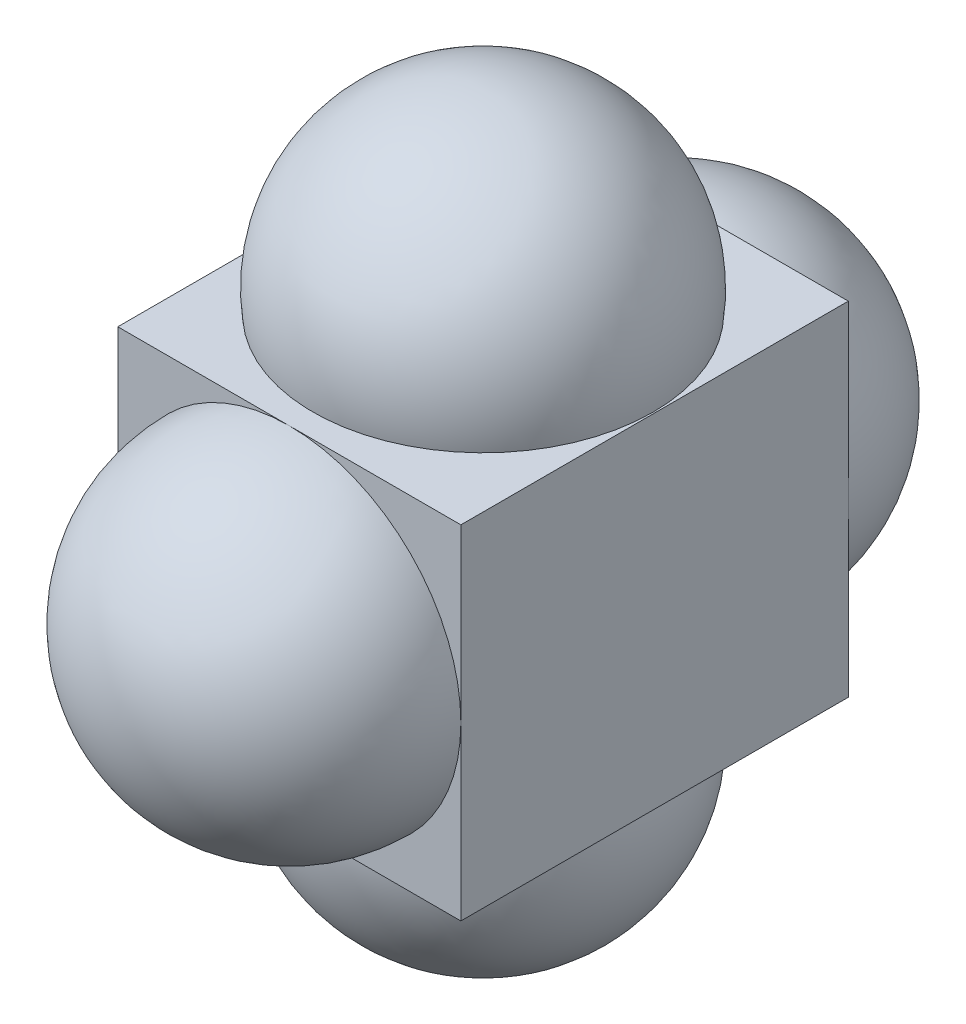
ISO-10303-21;
HEADER;
FILE_DESCRIPTION(('STEP AP214'),'2;1');
FILE_NAME('part.step','',(''),(''),'','','');
FILE_SCHEMA(('AUTOMOTIVE_DESIGN { 1 0 10303 214 1 1 1 1 }'));
ENDSEC;
DATA;
#1=APPLICATION_CONTEXT('core data for automotive mechanical design processes');
#2=APPLICATION_PROTOCOL_DEFINITION('international standard','automotive_design',2000,#1);
#3=PRODUCT_CONTEXT('',#1,'mechanical');
#4=PRODUCT('Part','Part','',(#3));
#5=PRODUCT_RELATED_PRODUCT_CATEGORY('part','',(#4));
#6=PRODUCT_DEFINITION_FORMATION('','',#4);
#7=PRODUCT_DEFINITION_CONTEXT('part definition',#1,'design');
#8=PRODUCT_DEFINITION('design','',#6,#7);
#9=PRODUCT_DEFINITION_SHAPE('','',#8);
#10=(LENGTH_UNIT() NAMED_UNIT(*) SI_UNIT(.MILLI.,.METRE.));
#11=(NAMED_UNIT(*) PLANE_ANGLE_UNIT() SI_UNIT($,.RADIAN.));
#12=(NAMED_UNIT(*) SI_UNIT($,.STERADIAN.) SOLID_ANGLE_UNIT());
#13=UNCERTAINTY_MEASURE_WITH_UNIT(LENGTH_MEASURE(1.E-05),#10,'distance_accuracy_value','');
#14=(GEOMETRIC_REPRESENTATION_CONTEXT(3) GLOBAL_UNCERTAINTY_ASSIGNED_CONTEXT((#13)) GLOBAL_UNIT_ASSIGNED_CONTEXT((#10,
#11,#12)) REPRESENTATION_CONTEXT('',''));
#15=CARTESIAN_POINT('',(0.,0.,0.));
#16=DIRECTION('',(0.,0.,1.));
#17=DIRECTION('',(1.,0.,0.));
#18=AXIS2_PLACEMENT_3D('',#15,#16,#17);
#19=CARTESIAN_POINT('',(-3.92641666666667,-3.92641666666667,-4.43441666666667));
#20=DIRECTION('',(0.,0.,1.));
#21=DIRECTION('',(1.,0.,0.));
#22=AXIS2_PLACEMENT_3D('',#19,#20,#21);
#23=PLANE('',#22);
#24=CARTESIAN_POINT('',(0.,0.,-4.43441666666667));
#25=DIRECTION('',(0.,0.,1.));
#26=DIRECTION('',(1.,0.,0.));
#27=AXIS2_PLACEMENT_3D('',#24,#25,#26);
#28=CIRCLE('',#27,3.92641666666667);
#29=CARTESIAN_POINT('',(3.92641666666666,0.,-4.43441666666667));
#30=VERTEX_POINT('',#29);
#31=CARTESIAN_POINT('',(0.,-3.92641666666667,-4.43441666666667));
#32=VERTEX_POINT('',#31);
#33=EDGE_CURVE('E11',#30,#32,#28,.F.);
#34=ORIENTED_EDGE('',*,*,#33,.F.);
#35=DIRECTION('',(0.,1.,0.));
#36=VECTOR('',#35,1.);
#37=CARTESIAN_POINT('',(3.92641666666666,3.92641666666666,-4.43441666666667));
#38=LINE('',#37,#36);
#39=CARTESIAN_POINT('',(3.92641666666666,-3.92641666666667,-4.43441666666667));
#40=VERTEX_POINT('',#39);
#41=EDGE_CURVE('E106',#40,#30,#38,.T.);
#42=ORIENTED_EDGE('',*,*,#41,.F.);
#43=DIRECTION('',(1.,0.,0.));
#44=VECTOR('',#43,1.);
#45=CARTESIAN_POINT('',(-3.92641666666667,-3.92641666666667,-4.43441666666667));
#46=LINE('',#45,#44);
#47=EDGE_CURVE('E122',#32,#40,#46,.T.);
#48=ORIENTED_EDGE('',*,*,#47,.F.);
#49=EDGE_LOOP('',(#34,#42,#48));
#50=FACE_BOUND('',#49,.T.);
#51=ADVANCED_FACE('F38',(#50),#23,.F.);
#52=CARTESIAN_POINT('',(-3.92641666666667,0.,-4.43441666666667));
#53=VERTEX_POINT('',#52);
#54=EDGE_CURVE('E47',#32,#53,#28,.F.);
#55=ORIENTED_EDGE('',*,*,#54,.F.);
#56=CARTESIAN_POINT('',(-3.92641666666667,-3.92641666666667,-4.43441666666667));
#57=VERTEX_POINT('',#56);
#58=EDGE_CURVE('E121',#57,#32,#46,.T.);
#59=ORIENTED_EDGE('',*,*,#58,.F.);
#60=DIRECTION('',(0.,-1.,0.));
#61=VECTOR('',#60,1.);
#62=CARTESIAN_POINT('',(-3.92641666666667,3.92641666666666,-4.43441666666667));
#63=LINE('',#62,#61);
#64=EDGE_CURVE('E167',#53,#57,#63,.T.);
#65=ORIENTED_EDGE('',*,*,#64,.F.);
#66=EDGE_LOOP('',(#55,#59,#65));
#67=FACE_BOUND('',#66,.T.);
#68=ADVANCED_FACE('F192',(#67),#23,.F.);
#69=CARTESIAN_POINT('',(0.,3.92641666666666,-4.43441666666667));
#70=VERTEX_POINT('',#69);
#71=EDGE_CURVE('E127',#53,#70,#28,.F.);
#72=ORIENTED_EDGE('',*,*,#71,.F.);
#73=CARTESIAN_POINT('',(-3.92641666666667,3.92641666666666,-4.43441666666667));
#74=VERTEX_POINT('',#73);
#75=EDGE_CURVE('E164',#74,#53,#63,.T.);
#76=ORIENTED_EDGE('',*,*,#75,.F.);
#77=DIRECTION('',(-1.,0.,0.));
#78=VECTOR('',#77,1.);
#79=CARTESIAN_POINT('',(-3.92641666666667,3.92641666666666,-4.43441666666667));
#80=LINE('',#79,#78);
#81=EDGE_CURVE('E116',#70,#74,#80,.T.);
#82=ORIENTED_EDGE('',*,*,#81,.F.);
#83=EDGE_LOOP('',(#72,#76,#82));
#84=FACE_BOUND('',#83,.T.);
#85=ADVANCED_FACE('F202',(#84),#23,.F.);
#86=EDGE_CURVE('E42',#70,#30,#28,.F.);
#87=ORIENTED_EDGE('',*,*,#86,.F.);
#88=CARTESIAN_POINT('',(3.92641666666666,3.92641666666666,-4.43441666666667));
#89=VERTEX_POINT('',#88);
#90=EDGE_CURVE('E120',#89,#70,#80,.T.);
#91=ORIENTED_EDGE('',*,*,#90,.F.);
#92=EDGE_CURVE('E109',#30,#89,#38,.T.);
#93=ORIENTED_EDGE('',*,*,#92,.F.);
#94=EDGE_LOOP('',(#87,#91,#93));
#95=FACE_BOUND('',#94,.T.);
#96=ADVANCED_FACE('F118',(#95),#23,.F.);
#97=CARTESIAN_POINT('',(-3.92641666666667,-3.92641666666667,4.43441666666667));
#98=DIRECTION('',(0.,0.,1.));
#99=DIRECTION('',(1.,0.,0.));
#100=AXIS2_PLACEMENT_3D('',#97,#98,#99);
#101=PLANE('',#100);
#102=DIRECTION('',(0.,1.,0.));
#103=VECTOR('',#102,1.);
#104=CARTESIAN_POINT('',(3.92641666666666,3.92641666666666,4.43441666666667));
#105=LINE('',#104,#103);
#106=CARTESIAN_POINT('',(3.92641666666666,-3.92641666666667,4.43441666666667));
#107=VERTEX_POINT('',#106);
#108=CARTESIAN_POINT('',(3.92641666666666,0.,4.43441666666667));
#109=VERTEX_POINT('',#108);
#110=EDGE_CURVE('E170',#107,#109,#105,.T.);
#111=ORIENTED_EDGE('',*,*,#110,.T.);
#112=CARTESIAN_POINT('',(0.,0.,4.43441666666667));
#113=DIRECTION('',(0.,0.,1.));
#114=DIRECTION('',(1.,0.,0.));
#115=AXIS2_PLACEMENT_3D('',#112,#113,#114);
#116=CIRCLE('',#115,3.92641666666666);
#117=CARTESIAN_POINT('',(0.,-3.92641666666667,4.43441666666667));
#118=VERTEX_POINT('',#117);
#119=EDGE_CURVE('E128',#109,#118,#116,.F.);
#120=ORIENTED_EDGE('',*,*,#119,.T.);
#121=DIRECTION('',(1.,0.,0.));
#122=VECTOR('',#121,1.);
#123=CARTESIAN_POINT('',(-3.92641666666667,-3.92641666666667,4.43441666666667));
#124=LINE('',#123,#122);
#125=EDGE_CURVE('E176',#118,#107,#124,.T.);
#126=ORIENTED_EDGE('',*,*,#125,.T.);
#127=EDGE_LOOP('',(#111,#120,#126));
#128=FACE_BOUND('',#127,.T.);
#129=ADVANCED_FACE('F193',(#128),#101,.T.);
#130=CARTESIAN_POINT('',(-3.92641666666667,-3.92641666666667,4.43441666666667));
#131=VERTEX_POINT('',#130);
#132=EDGE_CURVE('E173',#131,#118,#124,.T.);
#133=ORIENTED_EDGE('',*,*,#132,.T.);
#134=CARTESIAN_POINT('',(-3.92641666666667,0.,4.43441666666667));
#135=VERTEX_POINT('',#134);
#136=EDGE_CURVE('E130',#118,#135,#116,.F.);
#137=ORIENTED_EDGE('',*,*,#136,.T.);
#138=DIRECTION('',(0.,-1.,0.));
#139=VECTOR('',#138,1.);
#140=CARTESIAN_POINT('',(-3.92641666666667,3.92641666666666,4.43441666666667));
#141=LINE('',#140,#139);
#142=EDGE_CURVE('E161',#135,#131,#141,.T.);
#143=ORIENTED_EDGE('',*,*,#142,.T.);
#144=EDGE_LOOP('',(#133,#137,#143));
#145=FACE_BOUND('',#144,.T.);
#146=ADVANCED_FACE('F184',(#145),#101,.T.);
#147=CARTESIAN_POINT('',(-3.92641666666667,3.92641666666666,4.43441666666667));
#148=VERTEX_POINT('',#147);
#149=EDGE_CURVE('E177',#148,#135,#141,.T.);
#150=ORIENTED_EDGE('',*,*,#149,.T.);
#151=CARTESIAN_POINT('',(0.,3.92641666666666,4.43441666666667));
#152=VERTEX_POINT('',#151);
#153=EDGE_CURVE('E136',#135,#152,#116,.F.);
#154=ORIENTED_EDGE('',*,*,#153,.T.);
#155=DIRECTION('',(-1.,0.,0.));
#156=VECTOR('',#155,1.);
#157=CARTESIAN_POINT('',(-3.92641666666667,3.92641666666666,4.43441666666667));
#158=LINE('',#157,#156);
#159=EDGE_CURVE('E169',#152,#148,#158,.T.);
#160=ORIENTED_EDGE('',*,*,#159,.T.);
#161=EDGE_LOOP('',(#150,#154,#160));
#162=FACE_BOUND('',#161,.T.);
#163=ADVANCED_FACE('F201',(#162),#101,.T.);
#164=CARTESIAN_POINT('',(3.92641666666666,3.92641666666666,4.43441666666667));
#165=VERTEX_POINT('',#164);
#166=EDGE_CURVE('E160',#165,#152,#158,.T.);
#167=ORIENTED_EDGE('',*,*,#166,.T.);
#168=EDGE_CURVE('E131',#152,#109,#116,.F.);
#169=ORIENTED_EDGE('',*,*,#168,.T.);
#170=EDGE_CURVE('E172',#109,#165,#105,.T.);
#171=ORIENTED_EDGE('',*,*,#170,.T.);
#172=EDGE_LOOP('',(#167,#169,#171));
#173=FACE_BOUND('',#172,.T.);
#174=ADVANCED_FACE('F196',(#173),#101,.T.);
#175=CARTESIAN_POINT('',(-3.92641666666667,-3.92641666666667,4.43441666666667));
#176=DIRECTION('',(0.,1.,0.));
#177=DIRECTION('',(0.,0.,1.));
#178=AXIS2_PLACEMENT_3D('',#175,#176,#177);
#179=PLANE('',#178);
#180=ORIENTED_EDGE('',*,*,#58,.T.);
#181=ORIENTED_EDGE('',*,*,#47,.T.);
#182=DIRECTION('',(0.,0.,-1.));
#183=VECTOR('',#182,1.);
#184=CARTESIAN_POINT('',(3.92641666666666,-3.92641666666667,4.43441666666667));
#185=LINE('',#184,#183);
#186=EDGE_CURVE('E113',#107,#40,#185,.T.);
#187=ORIENTED_EDGE('',*,*,#186,.F.);
#188=ORIENTED_EDGE('',*,*,#125,.F.);
#189=ORIENTED_EDGE('',*,*,#132,.F.);
#190=DIRECTION('',(0.,0.,-1.));
#191=VECTOR('',#190,1.);
#192=CARTESIAN_POINT('',(-3.92641666666667,-3.92641666666667,4.43441666666667));
#193=LINE('',#192,#191);
#194=EDGE_CURVE('E149',#131,#57,#193,.T.);
#195=ORIENTED_EDGE('',*,*,#194,.T.);
#196=EDGE_LOOP('',(#180,#181,#187,#188,#189,#195));
#197=FACE_BOUND('',#196,.T.);
#198=CARTESIAN_POINT('',(0.,-3.92641666666667,0.));
#199=DIRECTION('',(0.,1.,0.));
#200=DIRECTION('',(0.,0.,1.));
#201=AXIS2_PLACEMENT_3D('',#198,#199,#200);
#202=CIRCLE('',#201,3.89341544665834);
#203=CARTESIAN_POINT('',(0.,-3.92641666666667,3.89341544665834));
#204=VERTEX_POINT('',#203);
#205=EDGE_CURVE('E139',#204,#204,#202,.F.);
#206=ORIENTED_EDGE('',*,*,#205,.F.);
#207=EDGE_LOOP('',(#206));
#208=FACE_BOUND('',#207,.T.);
#209=ADVANCED_FACE('F188',(#197,#208),#179,.F.);
#210=CARTESIAN_POINT('',(0.,4.43441666666667,0.));
#211=DIRECTION('',(0.,-1.,0.));
#212=DIRECTION('',(1.,0.,0.));
#213=AXIS2_PLACEMENT_3D('',#210,#211,#212);
#214=SPHERICAL_SURFACE('',#213,3.92641666666666);
#215=CARTESIAN_POINT('',(0.,3.92641666666666,0.));
#216=DIRECTION('',(0.,-1.,0.));
#217=DIRECTION('',(0.,0.,-1.));
#218=AXIS2_PLACEMENT_3D('',#215,#216,#217);
#219=CIRCLE('',#218,3.89341544665834);
#220=CARTESIAN_POINT('',(0.,3.92641666666666,-3.89341544665834));
#221=VERTEX_POINT('',#220);
#222=EDGE_CURVE('E145',#221,#221,#219,.T.);
#223=ORIENTED_EDGE('',*,*,#222,.F.);
#224=EDGE_LOOP('',(#223));
#225=FACE_BOUND('',#224,.T.);
#226=ADVANCED_FACE('F40',(#225),#214,.T.);
#227=CARTESIAN_POINT('',(-3.92641666666667,3.92641666666666,4.43441666666667));
#228=DIRECTION('',(0.,-1.,0.));
#229=DIRECTION('',(0.,0.,-1.));
#230=AXIS2_PLACEMENT_3D('',#227,#228,#229);
#231=PLANE('',#230);
#232=ORIENTED_EDGE('',*,*,#90,.T.);
#233=ORIENTED_EDGE('',*,*,#81,.T.);
#234=DIRECTION('',(0.,0.,-1.));
#235=VECTOR('',#234,1.);
#236=CARTESIAN_POINT('',(-3.92641666666667,3.92641666666666,4.43441666666667));
#237=LINE('',#236,#235);
#238=EDGE_CURVE('E157',#148,#74,#237,.T.);
#239=ORIENTED_EDGE('',*,*,#238,.F.);
#240=ORIENTED_EDGE('',*,*,#159,.F.);
#241=ORIENTED_EDGE('',*,*,#166,.F.);
#242=DIRECTION('',(0.,0.,-1.));
#243=VECTOR('',#242,1.);
#244=CARTESIAN_POINT('',(3.92641666666666,3.92641666666666,4.43441666666667));
#245=LINE('',#244,#243);
#246=EDGE_CURVE('E155',#165,#89,#245,.T.);
#247=ORIENTED_EDGE('',*,*,#246,.T.);
#248=EDGE_LOOP('',(#232,#233,#239,#240,#241,#247));
#249=FACE_BOUND('',#248,.T.);
#250=ORIENTED_EDGE('',*,*,#222,.T.);
#251=EDGE_LOOP('',(#250));
#252=FACE_BOUND('',#251,.T.);
#253=ADVANCED_FACE('F211',(#249,#252),#231,.F.);
#254=CARTESIAN_POINT('',(-3.92641666666667,3.92641666666666,4.43441666666667));
#255=DIRECTION('',(1.,0.,0.));
#256=DIRECTION('',(0.,1.,0.));
#257=AXIS2_PLACEMENT_3D('',#254,#255,#256);
#258=PLANE('',#257);
#259=ORIENTED_EDGE('',*,*,#75,.T.);
#260=ORIENTED_EDGE('',*,*,#64,.T.);
#261=ORIENTED_EDGE('',*,*,#194,.F.);
#262=ORIENTED_EDGE('',*,*,#142,.F.);
#263=ORIENTED_EDGE('',*,*,#149,.F.);
#264=ORIENTED_EDGE('',*,*,#238,.T.);
#265=EDGE_LOOP('',(#259,#260,#261,#262,#263,#264));
#266=FACE_BOUND('',#265,.T.);
#267=ADVANCED_FACE('F190',(#266),#258,.F.);
#268=CARTESIAN_POINT('',(3.92641666666666,3.92641666666666,4.43441666666667));
#269=DIRECTION('',(-1.,0.,0.));
#270=DIRECTION('',(0.,-1.,0.));
#271=AXIS2_PLACEMENT_3D('',#268,#269,#270);
#272=PLANE('',#271);
#273=ORIENTED_EDGE('',*,*,#41,.T.);
#274=ORIENTED_EDGE('',*,*,#92,.T.);
#275=ORIENTED_EDGE('',*,*,#246,.F.);
#276=ORIENTED_EDGE('',*,*,#170,.F.);
#277=ORIENTED_EDGE('',*,*,#110,.F.);
#278=ORIENTED_EDGE('',*,*,#186,.T.);
#279=EDGE_LOOP('',(#273,#274,#275,#276,#277,#278));
#280=FACE_BOUND('',#279,.T.);
#281=ADVANCED_FACE('F107',(#280),#272,.F.);
#282=CARTESIAN_POINT('',(0.,-4.43441666666667,0.));
#283=DIRECTION('',(0.,-1.,0.));
#284=DIRECTION('',(1.,0.,0.));
#285=AXIS2_PLACEMENT_3D('',#282,#283,#284);
#286=SPHERICAL_SURFACE('',#285,3.92641666666667);
#287=ORIENTED_EDGE('',*,*,#205,.T.);
#288=EDGE_LOOP('',(#287));
#289=FACE_BOUND('',#288,.T.);
#290=ADVANCED_FACE('F217',(#289),#286,.T.);
#291=CARTESIAN_POINT('',(0.,0.,4.43441666666667));
#292=DIRECTION('',(0.,0.,-1.));
#293=DIRECTION('',(-1.,0.,0.));
#294=AXIS2_PLACEMENT_3D('',#291,#292,#293);
#295=SPHERICAL_SURFACE('',#294,3.92641666666666);
#296=ORIENTED_EDGE('',*,*,#119,.F.);
#297=ORIENTED_EDGE('',*,*,#168,.F.);
#298=ORIENTED_EDGE('',*,*,#153,.F.);
#299=ORIENTED_EDGE('',*,*,#136,.F.);
#300=EDGE_LOOP('',(#296,#297,#298,#299));
#301=FACE_BOUND('',#300,.T.);
#302=ADVANCED_FACE('F235',(#301),#295,.T.);
#303=CARTESIAN_POINT('',(0.,0.,-4.43441666666667));
#304=DIRECTION('',(0.,0.,-1.));
#305=DIRECTION('',(-1.,0.,0.));
#306=AXIS2_PLACEMENT_3D('',#303,#304,#305);
#307=SPHERICAL_SURFACE('',#306,3.92641666666667);
#308=ORIENTED_EDGE('',*,*,#86,.T.);
#309=ORIENTED_EDGE('',*,*,#33,.T.);
#310=ORIENTED_EDGE('',*,*,#54,.T.);
#311=ORIENTED_EDGE('',*,*,#71,.T.);
#312=EDGE_LOOP('',(#308,#309,#310,#311));
#313=FACE_BOUND('',#312,.T.);
#314=ADVANCED_FACE('F126',(#313),#307,.T.);
#315=CLOSED_SHELL('',(#51,#68,#85,#96,#129,#146,#163,#174,#209,#226,#253,#267,#281,#290,#302,#314));
#316=MANIFOLD_SOLID_BREP('B2',#315);
#317=ADVANCED_BREP_SHAPE_REPRESENTATION('',(#18,#316),#14);
#318=SHAPE_DEFINITION_REPRESENTATION(#9,#317);
ENDSEC;
END-ISO-10303-21;
